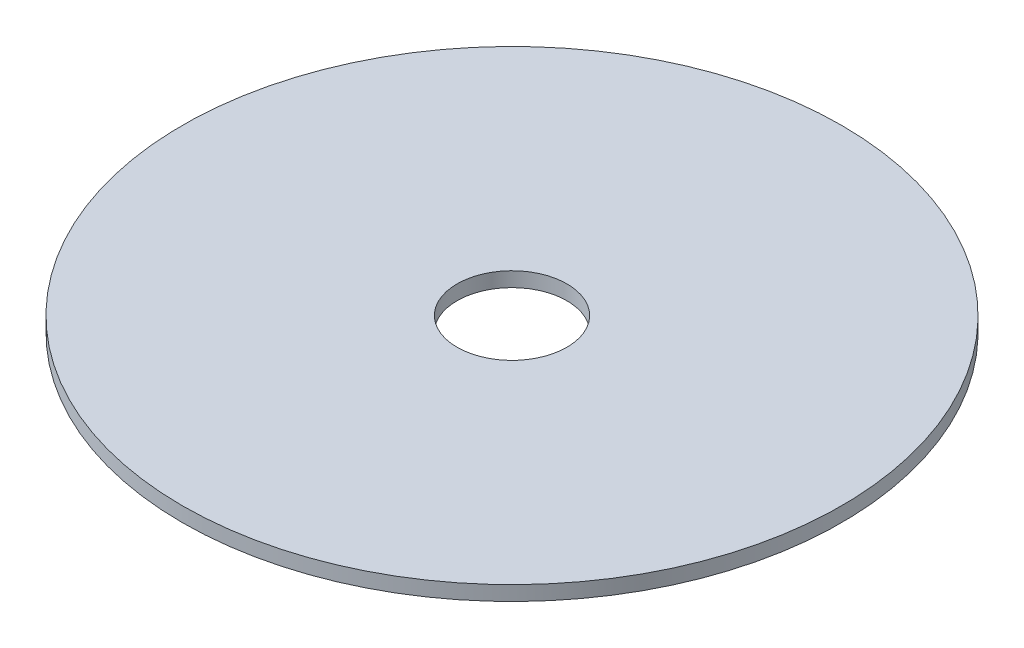
ISO-10303-21;
HEADER;
FILE_DESCRIPTION(('STEP AP214'),'2;1');
FILE_NAME('part.step','',(''),(''),'','','');
FILE_SCHEMA(('AUTOMOTIVE_DESIGN { 1 0 10303 214 1 1 1 1 }'));
ENDSEC;
DATA;
#1=APPLICATION_CONTEXT('core data for automotive mechanical design processes');
#2=APPLICATION_PROTOCOL_DEFINITION('international standard','automotive_design',2000,#1);
#3=PRODUCT_CONTEXT('',#1,'mechanical');
#4=PRODUCT('Part','Part','',(#3));
#5=PRODUCT_RELATED_PRODUCT_CATEGORY('part','',(#4));
#6=PRODUCT_DEFINITION_FORMATION('','',#4);
#7=PRODUCT_DEFINITION_CONTEXT('part definition',#1,'design');
#8=PRODUCT_DEFINITION('design','',#6,#7);
#9=PRODUCT_DEFINITION_SHAPE('','',#8);
#10=(LENGTH_UNIT() NAMED_UNIT(*) SI_UNIT(.MILLI.,.METRE.));
#11=(NAMED_UNIT(*) PLANE_ANGLE_UNIT() SI_UNIT($,.RADIAN.));
#12=(NAMED_UNIT(*) SI_UNIT($,.STERADIAN.) SOLID_ANGLE_UNIT());
#13=UNCERTAINTY_MEASURE_WITH_UNIT(LENGTH_MEASURE(1.E-05),#10,'distance_accuracy_value','');
#14=(GEOMETRIC_REPRESENTATION_CONTEXT(3) GLOBAL_UNCERTAINTY_ASSIGNED_CONTEXT((#13)) GLOBAL_UNIT_ASSIGNED_CONTEXT((#10,
#11,#12)) REPRESENTATION_CONTEXT('',''));
#15=CARTESIAN_POINT('',(0.,0.,0.));
#16=DIRECTION('',(0.,0.,1.));
#17=DIRECTION('',(1.,0.,0.));
#18=AXIS2_PLACEMENT_3D('',#15,#16,#17);
#19=CARTESIAN_POINT('',(0.,4.,0.));
#20=DIRECTION('',(0.,-1.,0.));
#21=DIRECTION('',(0.,0.,-1.));
#22=AXIS2_PLACEMENT_3D('',#19,#20,#21);
#23=CYLINDRICAL_SURFACE('',#22,90.);
#24=CARTESIAN_POINT('',(0.,4.,0.));
#25=DIRECTION('',(0.,1.,0.));
#26=DIRECTION('',(0.,0.,1.));
#27=AXIS2_PLACEMENT_3D('',#24,#25,#26);
#28=CIRCLE('',#27,90.);
#29=CARTESIAN_POINT('',(0.,4.,90.));
#30=VERTEX_POINT('',#29);
#31=EDGE_CURVE('E10',#30,#30,#28,.T.);
#32=ORIENTED_EDGE('',*,*,#31,.F.);
#33=EDGE_LOOP('',(#32));
#34=FACE_BOUND('',#33,.T.);
#35=CARTESIAN_POINT('',(0.,0.,0.));
#36=DIRECTION('',(0.,1.,0.));
#37=DIRECTION('',(0.,0.,1.));
#38=AXIS2_PLACEMENT_3D('',#35,#36,#37);
#39=CIRCLE('',#38,90.);
#40=CARTESIAN_POINT('',(0.,0.,90.));
#41=VERTEX_POINT('',#40);
#42=EDGE_CURVE('E37',#41,#41,#39,.T.);
#43=ORIENTED_EDGE('',*,*,#42,.T.);
#44=EDGE_LOOP('',(#43));
#45=FACE_BOUND('',#44,.T.);
#46=ADVANCED_FACE('F40',(#34,#45),#23,.T.);
#47=CARTESIAN_POINT('',(0.,4.,0.));
#48=DIRECTION('',(0.,1.,0.));
#49=DIRECTION('',(0.,0.,1.));
#50=AXIS2_PLACEMENT_3D('',#47,#48,#49);
#51=PLANE('',#50);
#52=CARTESIAN_POINT('',(0.,4.,0.));
#53=DIRECTION('',(0.,1.,0.));
#54=DIRECTION('',(0.,0.,1.));
#55=AXIS2_PLACEMENT_3D('',#52,#53,#54);
#56=CIRCLE('',#55,15.);
#57=CARTESIAN_POINT('',(0.,4.,15.));
#58=VERTEX_POINT('',#57);
#59=EDGE_CURVE('E50',#58,#58,#56,.T.);
#60=ORIENTED_EDGE('',*,*,#59,.F.);
#61=EDGE_LOOP('',(#60));
#62=FACE_BOUND('',#61,.T.);
#63=ORIENTED_EDGE('',*,*,#31,.T.);
#64=EDGE_LOOP('',(#63));
#65=FACE_BOUND('',#64,.T.);
#66=ADVANCED_FACE('F59',(#62,#65),#51,.T.);
#67=CARTESIAN_POINT('',(0.,0.,0.));
#68=DIRECTION('',(0.,1.,0.));
#69=DIRECTION('',(0.,0.,1.));
#70=AXIS2_PLACEMENT_3D('',#67,#68,#69);
#71=PLANE('',#70);
#72=CARTESIAN_POINT('',(0.,0.,0.));
#73=DIRECTION('',(0.,1.,0.));
#74=DIRECTION('',(0.,0.,1.));
#75=AXIS2_PLACEMENT_3D('',#72,#73,#74);
#76=CIRCLE('',#75,15.);
#77=CARTESIAN_POINT('',(0.,0.,15.));
#78=VERTEX_POINT('',#77);
#79=EDGE_CURVE('E47',#78,#78,#76,.T.);
#80=ORIENTED_EDGE('',*,*,#79,.T.);
#81=EDGE_LOOP('',(#80));
#82=FACE_BOUND('',#81,.T.);
#83=ORIENTED_EDGE('',*,*,#42,.F.);
#84=EDGE_LOOP('',(#83));
#85=FACE_BOUND('',#84,.T.);
#86=ADVANCED_FACE('F58',(#82,#85),#71,.F.);
#87=CARTESIAN_POINT('',(0.,4.,0.));
#88=DIRECTION('',(0.,-1.,0.));
#89=DIRECTION('',(0.,0.,-1.));
#90=AXIS2_PLACEMENT_3D('',#87,#88,#89);
#91=CYLINDRICAL_SURFACE('',#90,15.);
#92=ORIENTED_EDGE('',*,*,#59,.T.);
#93=EDGE_LOOP('',(#92));
#94=FACE_BOUND('',#93,.T.);
#95=ORIENTED_EDGE('',*,*,#79,.F.);
#96=EDGE_LOOP('',(#95));
#97=FACE_BOUND('',#96,.T.);
#98=ADVANCED_FACE('F54',(#94,#97),#91,.F.);
#99=CLOSED_SHELL('',(#46,#66,#86,#98));
#100=MANIFOLD_SOLID_BREP('B2',#99);
#101=ADVANCED_BREP_SHAPE_REPRESENTATION('',(#18,#100),#14);
#102=SHAPE_DEFINITION_REPRESENTATION(#9,#101);
ENDSEC;
END-ISO-10303-21;
